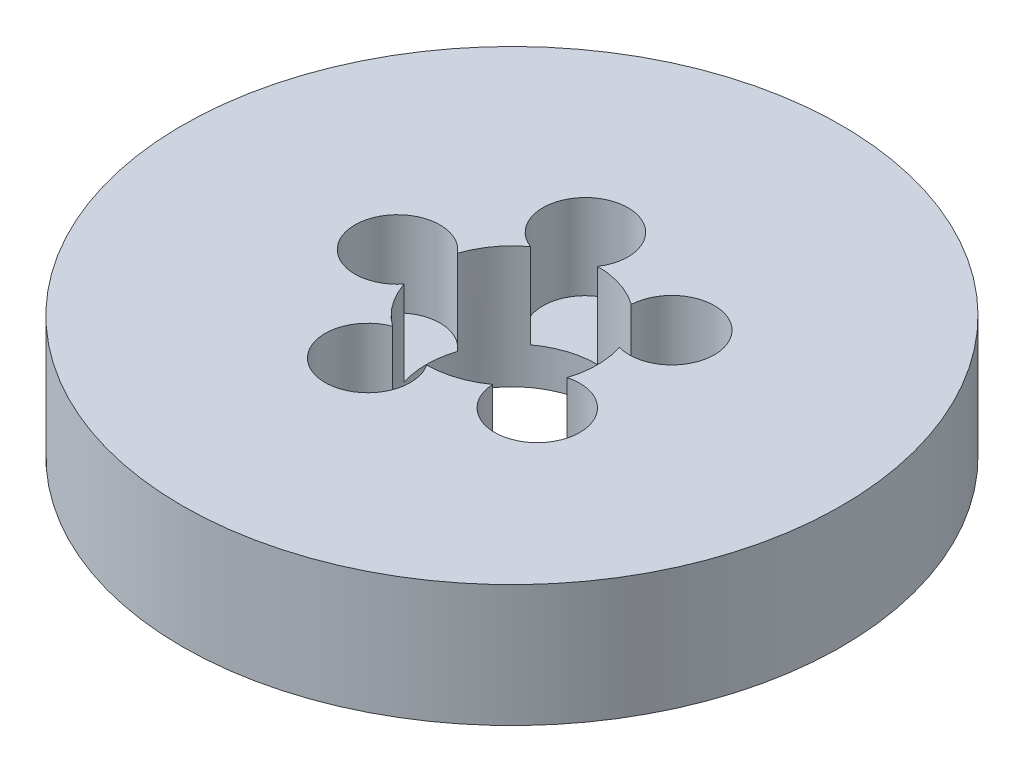
ISO-10303-21;
HEADER;
FILE_DESCRIPTION(('STEP AP214'),'2;1');
FILE_NAME('part.step','',(''),(''),'','','');
FILE_SCHEMA(('AUTOMOTIVE_DESIGN { 1 0 10303 214 1 1 1 1 }'));
ENDSEC;
DATA;
#1=APPLICATION_CONTEXT('core data for automotive mechanical design processes');
#2=APPLICATION_PROTOCOL_DEFINITION('international standard','automotive_design',2000,#1);
#3=PRODUCT_CONTEXT('',#1,'mechanical');
#4=PRODUCT('Part','Part','',(#3));
#5=PRODUCT_RELATED_PRODUCT_CATEGORY('part','',(#4));
#6=PRODUCT_DEFINITION_FORMATION('','',#4);
#7=PRODUCT_DEFINITION_CONTEXT('part definition',#1,'design');
#8=PRODUCT_DEFINITION('design','',#6,#7);
#9=PRODUCT_DEFINITION_SHAPE('','',#8);
#10=(LENGTH_UNIT() NAMED_UNIT(*) SI_UNIT(.MILLI.,.METRE.));
#11=(NAMED_UNIT(*) PLANE_ANGLE_UNIT() SI_UNIT($,.RADIAN.));
#12=(NAMED_UNIT(*) SI_UNIT($,.STERADIAN.) SOLID_ANGLE_UNIT());
#13=UNCERTAINTY_MEASURE_WITH_UNIT(LENGTH_MEASURE(1.E-05),#10,'distance_accuracy_value','');
#14=(GEOMETRIC_REPRESENTATION_CONTEXT(3) GLOBAL_UNCERTAINTY_ASSIGNED_CONTEXT((#13)) GLOBAL_UNIT_ASSIGNED_CONTEXT((#10,
#11,#12)) REPRESENTATION_CONTEXT('',''));
#15=CARTESIAN_POINT('',(0.,0.,0.));
#16=DIRECTION('',(0.,0.,1.));
#17=DIRECTION('',(1.,0.,0.));
#18=AXIS2_PLACEMENT_3D('',#15,#16,#17);
#19=CARTESIAN_POINT('',(0.,25.,0.));
#20=DIRECTION('',(0.,-1.,0.));
#21=DIRECTION('',(0.,0.,-1.));
#22=AXIS2_PLACEMENT_3D('',#19,#20,#21);
#23=CYLINDRICAL_SURFACE('',#22,67.5);
#24=CARTESIAN_POINT('',(0.,25.,0.));
#25=DIRECTION('',(0.,1.,0.));
#26=DIRECTION('',(0.,0.,1.));
#27=AXIS2_PLACEMENT_3D('',#24,#25,#26);
#28=CIRCLE('',#27,67.5);
#29=CARTESIAN_POINT('',(0.,25.,67.5));
#30=VERTEX_POINT('',#29);
#31=EDGE_CURVE('E157',#30,#30,#28,.T.);
#32=ORIENTED_EDGE('',*,*,#31,.F.);
#33=EDGE_LOOP('',(#32));
#34=FACE_BOUND('',#33,.T.);
#35=CARTESIAN_POINT('',(0.,0.,0.));
#36=DIRECTION('',(0.,1.,0.));
#37=DIRECTION('',(0.,0.,1.));
#38=AXIS2_PLACEMENT_3D('',#35,#36,#37);
#39=CIRCLE('',#38,67.5);
#40=CARTESIAN_POINT('',(0.,0.,67.5));
#41=VERTEX_POINT('',#40);
#42=EDGE_CURVE('E150',#41,#41,#39,.T.);
#43=ORIENTED_EDGE('',*,*,#42,.T.);
#44=EDGE_LOOP('',(#43));
#45=FACE_BOUND('',#44,.T.);
#46=ADVANCED_FACE('F39',(#34,#45),#23,.T.);
#47=CARTESIAN_POINT('',(0.,25.,0.));
#48=DIRECTION('',(0.,1.,0.));
#49=DIRECTION('',(0.,0.,1.));
#50=AXIS2_PLACEMENT_3D('',#47,#48,#49);
#51=PLANE('',#50);
#52=CARTESIAN_POINT('',(-7.24382393123751,25.,-22.294197659365));
#53=DIRECTION('',(0.,1.,0.));
#54=DIRECTION('',(-0.95105651629515,0.,0.309016994374958));
#55=AXIS2_PLACEMENT_3D('',#52,#53,#54);
#56=CIRCLE('',#55,8.72945253155312);
#57=CARTESIAN_POINT('',(0.0512627974651302,25.,-17.4999249177131));
#58=VERTEX_POINT('',#57);
#59=CARTESIAN_POINT('',(-10.3276702571861,25.,-14.127605142374));
#60=VERTEX_POINT('',#59);
#61=EDGE_CURVE('E194',#58,#60,#56,.T.);
#62=ORIENTED_EDGE('',*,*,#61,.F.);
#63=CARTESIAN_POINT('',(0.,25.,0.));
#64=DIRECTION('',(0.,1.,0.));
#65=DIRECTION('',(0.,0.,1.));
#66=AXIS2_PLACEMENT_3D('',#63,#64,#65);
#67=CIRCLE('',#66,17.5);
#68=CARTESIAN_POINT('',(10.2447253085286,25.,-14.187868175057));
#69=VERTEX_POINT('',#68);
#70=EDGE_CURVE('E147',#69,#58,#67,.T.);
#71=ORIENTED_EDGE('',*,*,#70,.F.);
#72=CARTESIAN_POINT('',(18.9645772604989,25.,-13.7785719053961));
#73=DIRECTION('',(0.,1.,0.));
#74=DIRECTION('',(-0.58778525229248,0.,-0.809016994374942));
#75=AXIS2_PLACEMENT_3D('',#72,#73,#74);
#76=CIRCLE('',#75,8.72945253155312);
#77=CARTESIAN_POINT('',(16.6592587032629,25.,-5.35902038228618));
#78=VERTEX_POINT('',#77);
#79=EDGE_CURVE('E254',#78,#69,#76,.T.);
#80=ORIENTED_EDGE('',*,*,#79,.F.);
#81=CARTESIAN_POINT('',(16.659258703263,25.,5.35902038228594));
#82=VERTEX_POINT('',#81);
#83=EDGE_CURVE('E144',#82,#78,#67,.T.);
#84=ORIENTED_EDGE('',*,*,#83,.F.);
#85=CARTESIAN_POINT('',(18.9645772604991,25.,13.7785719053958));
#86=DIRECTION('',(0.,1.,0.));
#87=DIRECTION('',(0.587785252292469,0.,-0.809016994374951));
#88=AXIS2_PLACEMENT_3D('',#85,#86,#87);
#89=CIRCLE('',#88,8.72945253155312);
#90=CARTESIAN_POINT('',(10.2447253085288,25.,14.1878681750568));
#91=VERTEX_POINT('',#90);
#92=EDGE_CURVE('E141',#91,#82,#89,.T.);
#93=ORIENTED_EDGE('',*,*,#92,.F.);
#94=CARTESIAN_POINT('',(0.0512627974653731,25.,17.4999249177131));
#95=VERTEX_POINT('',#94);
#96=EDGE_CURVE('E134',#95,#91,#67,.T.);
#97=ORIENTED_EDGE('',*,*,#96,.F.);
#98=CARTESIAN_POINT('',(-7.2438239312372,25.,22.2941976593651));
#99=DIRECTION('',(0.,1.,0.));
#100=DIRECTION('',(0.951056516295155,0.,0.309016994374945));
#101=AXIS2_PLACEMENT_3D('',#98,#99,#100);
#102=CIRCLE('',#101,8.72945253155312);
#103=CARTESIAN_POINT('',(-10.3276702571859,25.,14.1276051423742));
#104=VERTEX_POINT('',#103);
#105=EDGE_CURVE('E111',#104,#95,#102,.T.);
#106=ORIENTED_EDGE('',*,*,#105,.F.);
#107=CARTESIAN_POINT('',(-16.627576552071,25.,5.45652801743187));
#108=VERTEX_POINT('',#107);
#109=EDGE_CURVE('E145',#108,#104,#67,.T.);
#110=ORIENTED_EDGE('',*,*,#109,.F.);
#111=CARTESIAN_POINT('',(-23.4415066585235,25.,0.));
#112=DIRECTION('',(0.,1.,0.));
#113=DIRECTION('',(0.,0.,1.));
#114=AXIS2_PLACEMENT_3D('',#111,#112,#113);
#115=CIRCLE('',#114,8.72945253155312);
#116=CARTESIAN_POINT('',(-16.627576552071,25.,-5.45652801743187));
#117=VERTEX_POINT('',#116);
#118=EDGE_CURVE('E153',#117,#108,#115,.T.);
#119=ORIENTED_EDGE('',*,*,#118,.F.);
#120=EDGE_CURVE('E146',#60,#117,#67,.T.);
#121=ORIENTED_EDGE('',*,*,#120,.F.);
#122=EDGE_LOOP('',(#62,#71,#80,#84,#93,#97,#106,#110,#119,#121));
#123=FACE_BOUND('',#122,.T.);
#124=ORIENTED_EDGE('',*,*,#31,.T.);
#125=EDGE_LOOP('',(#124));
#126=FACE_BOUND('',#125,.T.);
#127=ADVANCED_FACE('F139',(#123,#126),#51,.T.);
#128=CARTESIAN_POINT('',(0.,0.,0.));
#129=DIRECTION('',(0.,1.,0.));
#130=DIRECTION('',(0.,0.,1.));
#131=AXIS2_PLACEMENT_3D('',#128,#129,#130);
#132=PLANE('',#131);
#133=CARTESIAN_POINT('',(0.,0.,0.));
#134=DIRECTION('',(0.,1.,0.));
#135=DIRECTION('',(0.,0.,1.));
#136=AXIS2_PLACEMENT_3D('',#133,#134,#135);
#137=CIRCLE('',#136,17.5);
#138=CARTESIAN_POINT('',(0.,0.,17.5));
#139=VERTEX_POINT('',#138);
#140=EDGE_CURVE('E154',#139,#139,#137,.T.);
#141=ORIENTED_EDGE('',*,*,#140,.T.);
#142=EDGE_LOOP('',(#141));
#143=FACE_BOUND('',#142,.T.);
#144=ORIENTED_EDGE('',*,*,#42,.F.);
#145=EDGE_LOOP('',(#144));
#146=FACE_BOUND('',#145,.T.);
#147=ADVANCED_FACE('F213',(#143,#146),#132,.F.);
#148=CARTESIAN_POINT('',(0.,25.,0.));
#149=DIRECTION('',(0.,-1.,0.));
#150=DIRECTION('',(0.,0.,-1.));
#151=AXIS2_PLACEMENT_3D('',#148,#149,#150);
#152=CYLINDRICAL_SURFACE('',#151,17.5);
#153=DIRECTION('',(0.,1.,0.));
#154=VECTOR('',#153,1.);
#155=CARTESIAN_POINT('',(0.0512627974651294,16.2933538746351,-17.4999249177131));
#156=LINE('',#155,#154);
#157=CARTESIAN_POINT('',(0.0512627974651302,7.58670774927028,-17.4999249177131));
#158=VERTEX_POINT('',#157);
#159=EDGE_CURVE('E11',#158,#58,#156,.T.);
#160=ORIENTED_EDGE('',*,*,#159,.F.);
#161=CARTESIAN_POINT('',(0.,7.58670774927028,0.));
#162=DIRECTION('',(0.,1.,0.));
#163=DIRECTION('',(0.,0.,1.));
#164=AXIS2_PLACEMENT_3D('',#161,#162,#163);
#165=CIRCLE('',#164,17.5);
#166=CARTESIAN_POINT('',(-10.3276702571861,7.58670774927028,-14.127605142374));
#167=VERTEX_POINT('',#166);
#168=EDGE_CURVE('E189',#158,#167,#165,.T.);
#169=ORIENTED_EDGE('',*,*,#168,.T.);
#170=DIRECTION('',(0.,1.,0.));
#171=VECTOR('',#170,1.);
#172=CARTESIAN_POINT('',(-10.3276702571862,16.2933538746351,-14.127605142374));
#173=LINE('',#172,#171);
#174=EDGE_CURVE('E46',#60,#167,#173,.F.);
#175=ORIENTED_EDGE('',*,*,#174,.F.);
#176=ORIENTED_EDGE('',*,*,#120,.T.);
#177=DIRECTION('',(0.,1.,0.));
#178=VECTOR('',#177,1.);
#179=CARTESIAN_POINT('',(-16.627576552071,16.2933538746351,-5.45652801743187));
#180=LINE('',#179,#178);
#181=CARTESIAN_POINT('',(-16.627576552071,7.58670774927028,-5.45652801743187));
#182=VERTEX_POINT('',#181);
#183=EDGE_CURVE('E168',#182,#117,#180,.T.);
#184=ORIENTED_EDGE('',*,*,#183,.F.);
#185=CARTESIAN_POINT('',(0.,7.58670774927028,0.));
#186=DIRECTION('',(0.,1.,0.));
#187=DIRECTION('',(0.,0.,1.));
#188=AXIS2_PLACEMENT_3D('',#185,#186,#187);
#189=CIRCLE('',#188,17.5);
#190=CARTESIAN_POINT('',(-16.627576552071,7.58670774927028,5.45652801743187));
#191=VERTEX_POINT('',#190);
#192=EDGE_CURVE('E165',#182,#191,#189,.T.);
#193=ORIENTED_EDGE('',*,*,#192,.T.);
#194=DIRECTION('',(0.,1.,0.));
#195=VECTOR('',#194,1.);
#196=CARTESIAN_POINT('',(-16.627576552071,16.2933538746351,5.45652801743187));
#197=LINE('',#196,#195);
#198=EDGE_CURVE('E170',#108,#191,#197,.F.);
#199=ORIENTED_EDGE('',*,*,#198,.F.);
#200=ORIENTED_EDGE('',*,*,#109,.T.);
#201=DIRECTION('',(0.,1.,0.));
#202=VECTOR('',#201,1.);
#203=CARTESIAN_POINT('',(-10.3276702571859,16.2933538746351,14.1276051423742));
#204=LINE('',#203,#202);
#205=CARTESIAN_POINT('',(-10.3276702571859,7.58670774927028,14.1276051423742));
#206=VERTEX_POINT('',#205);
#207=EDGE_CURVE('E121',#206,#104,#204,.T.);
#208=ORIENTED_EDGE('',*,*,#207,.F.);
#209=CARTESIAN_POINT('',(0.,7.58670774927028,0.));
#210=DIRECTION('',(0.,1.,0.));
#211=DIRECTION('',(0.,0.,1.));
#212=AXIS2_PLACEMENT_3D('',#209,#210,#211);
#213=CIRCLE('',#212,17.5);
#214=CARTESIAN_POINT('',(0.0512627974653731,7.58670774927028,17.4999249177131));
#215=VERTEX_POINT('',#214);
#216=EDGE_CURVE('E136',#206,#215,#213,.T.);
#217=ORIENTED_EDGE('',*,*,#216,.T.);
#218=DIRECTION('',(0.,1.,0.));
#219=VECTOR('',#218,1.);
#220=CARTESIAN_POINT('',(0.0512627974653714,16.2933538746351,17.4999249177131));
#221=LINE('',#220,#219);
#222=EDGE_CURVE('E117',#95,#215,#221,.F.);
#223=ORIENTED_EDGE('',*,*,#222,.F.);
#224=ORIENTED_EDGE('',*,*,#96,.T.);
#225=DIRECTION('',(0.,1.,0.));
#226=VECTOR('',#225,1.);
#227=CARTESIAN_POINT('',(10.2447253085288,16.2933538746351,14.1878681750568));
#228=LINE('',#227,#226);
#229=CARTESIAN_POINT('',(10.2447253085288,7.58670774927028,14.1878681750568));
#230=VERTEX_POINT('',#229);
#231=EDGE_CURVE('E182',#230,#91,#228,.T.);
#232=ORIENTED_EDGE('',*,*,#231,.F.);
#233=CARTESIAN_POINT('',(0.,7.58670774927028,0.));
#234=DIRECTION('',(0.,1.,0.));
#235=DIRECTION('',(0.,0.,1.));
#236=AXIS2_PLACEMENT_3D('',#233,#234,#235);
#237=CIRCLE('',#236,17.5);
#238=CARTESIAN_POINT('',(16.659258703263,7.58670774927028,5.35902038228594));
#239=VERTEX_POINT('',#238);
#240=EDGE_CURVE('E174',#230,#239,#237,.T.);
#241=ORIENTED_EDGE('',*,*,#240,.T.);
#242=DIRECTION('',(0.,1.,0.));
#243=VECTOR('',#242,1.);
#244=CARTESIAN_POINT('',(16.659258703263,16.2933538746351,5.35902038228595));
#245=LINE('',#244,#243);
#246=EDGE_CURVE('E177',#82,#239,#245,.F.);
#247=ORIENTED_EDGE('',*,*,#246,.F.);
#248=ORIENTED_EDGE('',*,*,#83,.T.);
#249=DIRECTION('',(0.,1.,0.));
#250=VECTOR('',#249,1.);
#251=CARTESIAN_POINT('',(16.6592587032629,16.2933538746351,-5.35902038228618));
#252=LINE('',#251,#250);
#253=CARTESIAN_POINT('',(16.6592587032629,7.58670774927028,-5.35902038228618));
#254=VERTEX_POINT('',#253);
#255=EDGE_CURVE('E187',#254,#78,#252,.T.);
#256=ORIENTED_EDGE('',*,*,#255,.F.);
#257=CARTESIAN_POINT('',(0.,7.58670774927028,0.));
#258=DIRECTION('',(0.,1.,0.));
#259=DIRECTION('',(0.,0.,1.));
#260=AXIS2_PLACEMENT_3D('',#257,#258,#259);
#261=CIRCLE('',#260,17.5);
#262=CARTESIAN_POINT('',(10.2447253085286,7.58670774927028,-14.187868175057));
#263=VERTEX_POINT('',#262);
#264=EDGE_CURVE('E181',#254,#263,#261,.T.);
#265=ORIENTED_EDGE('',*,*,#264,.T.);
#266=DIRECTION('',(0.,1.,0.));
#267=VECTOR('',#266,1.);
#268=CARTESIAN_POINT('',(10.2447253085286,16.2933538746351,-14.187868175057));
#269=LINE('',#268,#267);
#270=EDGE_CURVE('E186',#69,#263,#269,.F.);
#271=ORIENTED_EDGE('',*,*,#270,.F.);
#272=ORIENTED_EDGE('',*,*,#70,.T.);
#273=EDGE_LOOP('',(#160,#169,#175,#176,#184,#193,#199,#200,#208,#217,#223,#224,#232,#241,#247,
#248,#256,#265,#271,#272));
#274=FACE_BOUND('',#273,.T.);
#275=ORIENTED_EDGE('',*,*,#140,.F.);
#276=EDGE_LOOP('',(#275));
#277=FACE_BOUND('',#276,.T.);
#278=ADVANCED_FACE('F135',(#274,#277),#152,.F.);
#279=CARTESIAN_POINT('',(-23.4415066585235,7.58670774927028,0.));
#280=DIRECTION('',(0.,1.,0.));
#281=DIRECTION('',(0.,0.,1.));
#282=AXIS2_PLACEMENT_3D('',#279,#280,#281);
#283=CYLINDRICAL_SURFACE('',#282,8.72945253155312);
#284=ORIENTED_EDGE('',*,*,#183,.T.);
#285=ORIENTED_EDGE('',*,*,#118,.T.);
#286=ORIENTED_EDGE('',*,*,#198,.T.);
#287=CARTESIAN_POINT('',(-23.4415066585235,7.58670774927028,0.));
#288=DIRECTION('',(0.,1.,0.));
#289=DIRECTION('',(0.,0.,1.));
#290=AXIS2_PLACEMENT_3D('',#287,#288,#289);
#291=CIRCLE('',#290,8.72945253155312);
#292=EDGE_CURVE('E158',#182,#191,#291,.T.);
#293=ORIENTED_EDGE('',*,*,#292,.F.);
#294=EDGE_LOOP('',(#284,#285,#286,#293));
#295=FACE_BOUND('',#294,.T.);
#296=ADVANCED_FACE('F221',(#295),#283,.F.);
#297=CARTESIAN_POINT('',(-23.4415066585235,7.58670774927028,0.));
#298=DIRECTION('',(0.,1.,0.));
#299=DIRECTION('',(0.,0.,1.));
#300=AXIS2_PLACEMENT_3D('',#297,#298,#299);
#301=PLANE('',#300);
#302=ORIENTED_EDGE('',*,*,#292,.T.);
#303=ORIENTED_EDGE('',*,*,#192,.F.);
#304=EDGE_LOOP('',(#302,#303));
#305=FACE_BOUND('',#304,.T.);
#306=ADVANCED_FACE('F227',(#305),#301,.T.);
#307=CARTESIAN_POINT('',(-7.2438239312372,7.58670774927028,22.2941976593651));
#308=DIRECTION('',(0.,1.,0.));
#309=DIRECTION('',(0.,0.,1.));
#310=AXIS2_PLACEMENT_3D('',#307,#308,#309);
#311=CYLINDRICAL_SURFACE('',#310,8.72945253155312);
#312=ORIENTED_EDGE('',*,*,#207,.T.);
#313=ORIENTED_EDGE('',*,*,#105,.T.);
#314=ORIENTED_EDGE('',*,*,#222,.T.);
#315=CARTESIAN_POINT('',(-7.2438239312372,7.58670774927028,22.2941976593651));
#316=DIRECTION('',(0.,1.,0.));
#317=DIRECTION('',(0.951056516295155,0.,0.309016994374945));
#318=AXIS2_PLACEMENT_3D('',#315,#316,#317);
#319=CIRCLE('',#318,8.72945253155312);
#320=EDGE_CURVE('E127',#206,#215,#319,.T.);
#321=ORIENTED_EDGE('',*,*,#320,.F.);
#322=EDGE_LOOP('',(#312,#313,#314,#321));
#323=FACE_BOUND('',#322,.T.);
#324=ADVANCED_FACE('F116',(#323),#311,.F.);
#325=CARTESIAN_POINT('',(-7.2438239312372,7.58670774927028,22.2941976593651));
#326=DIRECTION('',(0.,1.,0.));
#327=DIRECTION('',(0.951056516295155,0.,0.309016994374945));
#328=AXIS2_PLACEMENT_3D('',#325,#326,#327);
#329=PLANE('',#328);
#330=ORIENTED_EDGE('',*,*,#320,.T.);
#331=ORIENTED_EDGE('',*,*,#216,.F.);
#332=EDGE_LOOP('',(#330,#331));
#333=FACE_BOUND('',#332,.T.);
#334=ADVANCED_FACE('F234',(#333),#329,.T.);
#335=CARTESIAN_POINT('',(18.9645772604991,7.58670774927028,13.7785719053958));
#336=DIRECTION('',(0.,1.,0.));
#337=DIRECTION('',(0.,0.,1.));
#338=AXIS2_PLACEMENT_3D('',#335,#336,#337);
#339=CYLINDRICAL_SURFACE('',#338,8.72945253155312);
#340=ORIENTED_EDGE('',*,*,#231,.T.);
#341=ORIENTED_EDGE('',*,*,#92,.T.);
#342=ORIENTED_EDGE('',*,*,#246,.T.);
#343=CARTESIAN_POINT('',(18.9645772604991,7.58670774927028,13.7785719053958));
#344=DIRECTION('',(0.,1.,0.));
#345=DIRECTION('',(0.587785252292469,0.,-0.809016994374951));
#346=AXIS2_PLACEMENT_3D('',#343,#344,#345);
#347=CIRCLE('',#346,8.72945253155312);
#348=EDGE_CURVE('E130',#230,#239,#347,.T.);
#349=ORIENTED_EDGE('',*,*,#348,.F.);
#350=EDGE_LOOP('',(#340,#341,#342,#349));
#351=FACE_BOUND('',#350,.T.);
#352=ADVANCED_FACE('F240',(#351),#339,.F.);
#353=CARTESIAN_POINT('',(18.9645772604991,7.58670774927028,13.7785719053958));
#354=DIRECTION('',(0.,1.,0.));
#355=DIRECTION('',(0.587785252292469,0.,-0.809016994374951));
#356=AXIS2_PLACEMENT_3D('',#353,#354,#355);
#357=PLANE('',#356);
#358=ORIENTED_EDGE('',*,*,#348,.T.);
#359=ORIENTED_EDGE('',*,*,#240,.F.);
#360=EDGE_LOOP('',(#358,#359));
#361=FACE_BOUND('',#360,.T.);
#362=ADVANCED_FACE('F245',(#361),#357,.T.);
#363=CARTESIAN_POINT('',(18.9645772604989,7.58670774927028,-13.7785719053961));
#364=DIRECTION('',(0.,1.,0.));
#365=DIRECTION('',(0.,0.,1.));
#366=AXIS2_PLACEMENT_3D('',#363,#364,#365);
#367=CYLINDRICAL_SURFACE('',#366,8.72945253155312);
#368=ORIENTED_EDGE('',*,*,#255,.T.);
#369=ORIENTED_EDGE('',*,*,#79,.T.);
#370=ORIENTED_EDGE('',*,*,#270,.T.);
#371=CARTESIAN_POINT('',(18.9645772604989,7.58670774927028,-13.7785719053961));
#372=DIRECTION('',(0.,1.,0.));
#373=DIRECTION('',(-0.58778525229248,0.,-0.809016994374942));
#374=AXIS2_PLACEMENT_3D('',#371,#372,#373);
#375=CIRCLE('',#374,8.72945253155312);
#376=EDGE_CURVE('E56',#254,#263,#375,.T.);
#377=ORIENTED_EDGE('',*,*,#376,.F.);
#378=EDGE_LOOP('',(#368,#369,#370,#377));
#379=FACE_BOUND('',#378,.T.);
#380=ADVANCED_FACE('F266',(#379),#367,.F.);
#381=CARTESIAN_POINT('',(18.9645772604989,7.58670774927028,-13.7785719053961));
#382=DIRECTION('',(0.,1.,0.));
#383=DIRECTION('',(-0.58778525229248,0.,-0.809016994374942));
#384=AXIS2_PLACEMENT_3D('',#381,#382,#383);
#385=PLANE('',#384);
#386=ORIENTED_EDGE('',*,*,#376,.T.);
#387=ORIENTED_EDGE('',*,*,#264,.F.);
#388=EDGE_LOOP('',(#386,#387));
#389=FACE_BOUND('',#388,.T.);
#390=ADVANCED_FACE('F204',(#389),#385,.T.);
#391=CARTESIAN_POINT('',(-7.24382393123751,7.58670774927028,-22.294197659365));
#392=DIRECTION('',(0.,1.,0.));
#393=DIRECTION('',(0.,0.,1.));
#394=AXIS2_PLACEMENT_3D('',#391,#392,#393);
#395=CYLINDRICAL_SURFACE('',#394,8.72945253155312);
#396=ORIENTED_EDGE('',*,*,#159,.T.);
#397=ORIENTED_EDGE('',*,*,#61,.T.);
#398=ORIENTED_EDGE('',*,*,#174,.T.);
#399=CARTESIAN_POINT('',(-7.24382393123751,7.58670774927028,-22.294197659365));
#400=DIRECTION('',(0.,1.,0.));
#401=DIRECTION('',(-0.95105651629515,0.,0.309016994374958));
#402=AXIS2_PLACEMENT_3D('',#399,#400,#401);
#403=CIRCLE('',#402,8.72945253155312);
#404=EDGE_CURVE('E55',#158,#167,#403,.T.);
#405=ORIENTED_EDGE('',*,*,#404,.F.);
#406=EDGE_LOOP('',(#396,#397,#398,#405));
#407=FACE_BOUND('',#406,.T.);
#408=ADVANCED_FACE('F193',(#407),#395,.F.);
#409=CARTESIAN_POINT('',(-7.24382393123751,7.58670774927028,-22.294197659365));
#410=DIRECTION('',(0.,1.,0.));
#411=DIRECTION('',(-0.95105651629515,0.,0.309016994374958));
#412=AXIS2_PLACEMENT_3D('',#409,#410,#411);
#413=PLANE('',#412);
#414=ORIENTED_EDGE('',*,*,#404,.T.);
#415=ORIENTED_EDGE('',*,*,#168,.F.);
#416=EDGE_LOOP('',(#414,#415));
#417=FACE_BOUND('',#416,.T.);
#418=ADVANCED_FACE('F196',(#417),#413,.T.);
#419=CLOSED_SHELL('',(#46,#127,#147,#278,#296,#306,#324,#334,#352,#362,#380,#390,#408,#418));
#420=MANIFOLD_SOLID_BREP('B2',#419);
#421=ADVANCED_BREP_SHAPE_REPRESENTATION('',(#18,#420),#14);
#422=SHAPE_DEFINITION_REPRESENTATION(#9,#421);
ENDSEC;
END-ISO-10303-21;
